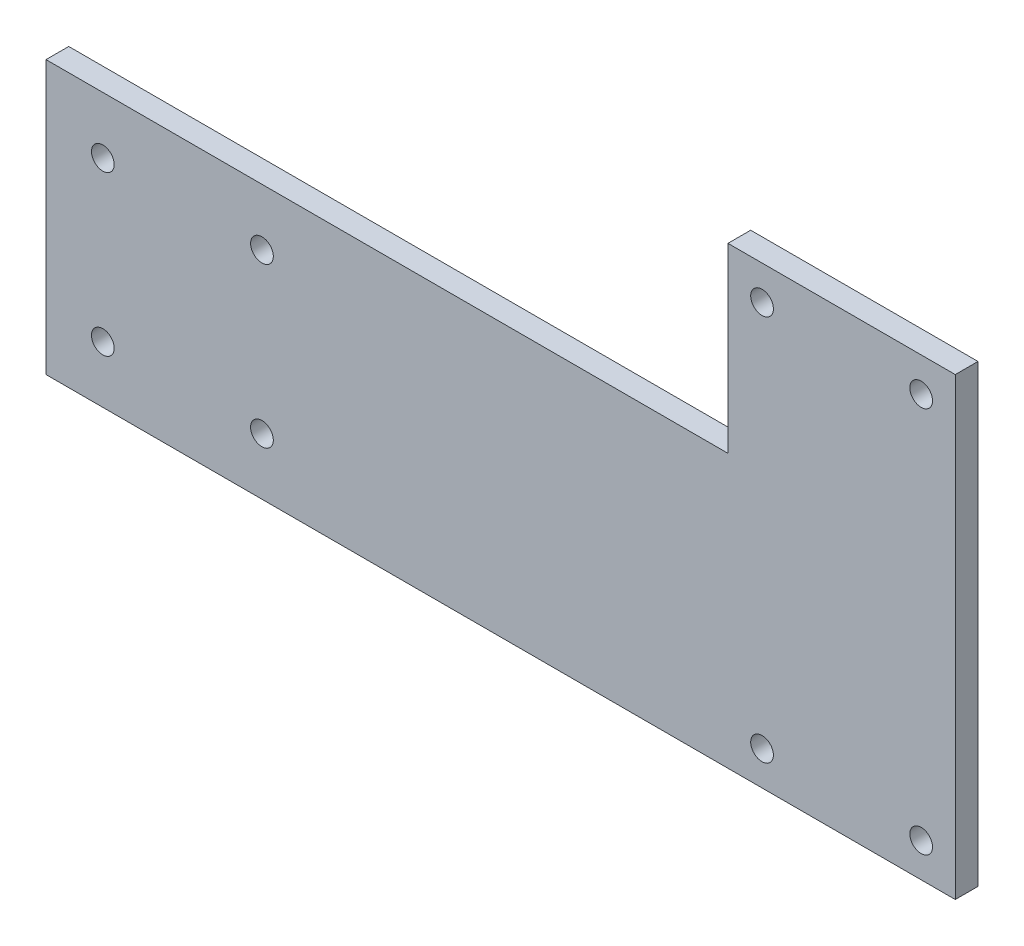
ISO-10303-21;
HEADER;
FILE_DESCRIPTION(('STEP AP214'),'2;1');
FILE_NAME('part.step','',(''),(''),'','','');
FILE_SCHEMA(('AUTOMOTIVE_DESIGN { 1 0 10303 214 1 1 1 1 }'));
ENDSEC;
DATA;
#1=APPLICATION_CONTEXT('core data for automotive mechanical design processes');
#2=APPLICATION_PROTOCOL_DEFINITION('international standard','automotive_design',2000,#1);
#3=PRODUCT_CONTEXT('',#1,'mechanical');
#4=PRODUCT('Part','Part','',(#3));
#5=PRODUCT_RELATED_PRODUCT_CATEGORY('part','',(#4));
#6=PRODUCT_DEFINITION_FORMATION('','',#4);
#7=PRODUCT_DEFINITION_CONTEXT('part definition',#1,'design');
#8=PRODUCT_DEFINITION('design','',#6,#7);
#9=PRODUCT_DEFINITION_SHAPE('','',#8);
#10=(LENGTH_UNIT() NAMED_UNIT(*) SI_UNIT(.MILLI.,.METRE.));
#11=(NAMED_UNIT(*) PLANE_ANGLE_UNIT() SI_UNIT($,.RADIAN.));
#12=(NAMED_UNIT(*) SI_UNIT($,.STERADIAN.) SOLID_ANGLE_UNIT());
#13=UNCERTAINTY_MEASURE_WITH_UNIT(LENGTH_MEASURE(1.E-05),#10,'distance_accuracy_value','');
#14=(GEOMETRIC_REPRESENTATION_CONTEXT(3) GLOBAL_UNCERTAINTY_ASSIGNED_CONTEXT((#13)) GLOBAL_UNIT_ASSIGNED_CONTEXT((#10,
#11,#12)) REPRESENTATION_CONTEXT('',''));
#15=CARTESIAN_POINT('',(0.,0.,0.));
#16=DIRECTION('',(0.,0.,1.));
#17=DIRECTION('',(1.,0.,0.));
#18=AXIS2_PLACEMENT_3D('',#15,#16,#17);
#19=CARTESIAN_POINT('',(0.,0.,5.));
#20=DIRECTION('',(0.,0.,1.));
#21=DIRECTION('',(1.,0.,0.));
#22=AXIS2_PLACEMENT_3D('',#19,#20,#21);
#23=PLANE('',#22);
#24=DIRECTION('',(0.,1.,0.));
#25=VECTOR('',#24,1.);
#26=CARTESIAN_POINT('',(50.,50.,5.));
#27=LINE('',#26,#25);
#28=CARTESIAN_POINT('',(50.,10.,5.));
#29=VERTEX_POINT('',#28);
#30=CARTESIAN_POINT('',(50.,50.,5.));
#31=VERTEX_POINT('',#30);
#32=EDGE_CURVE('E115',#29,#31,#27,.T.);
#33=ORIENTED_EDGE('',*,*,#32,.F.);
#34=DIRECTION('',(1.,0.,0.));
#35=VECTOR('',#34,1.);
#36=CARTESIAN_POINT('',(50.,10.,5.));
#37=LINE('',#36,#35);
#38=CARTESIAN_POINT('',(-100.,10.,5.));
#39=VERTEX_POINT('',#38);
#40=EDGE_CURVE('E107',#39,#29,#37,.T.);
#41=ORIENTED_EDGE('',*,*,#40,.F.);
#42=DIRECTION('',(0.,-1.,0.));
#43=VECTOR('',#42,1.);
#44=CARTESIAN_POINT('',(-100.,50.,5.));
#45=LINE('',#44,#43);
#46=CARTESIAN_POINT('',(-100.,-50.,5.));
#47=VERTEX_POINT('',#46);
#48=EDGE_CURVE('E113',#39,#47,#45,.T.);
#49=ORIENTED_EDGE('',*,*,#48,.T.);
#50=DIRECTION('',(1.,0.,0.));
#51=VECTOR('',#50,1.);
#52=CARTESIAN_POINT('',(-100.,-50.,5.));
#53=LINE('',#52,#51);
#54=CARTESIAN_POINT('',(100.,-50.,5.));
#55=VERTEX_POINT('',#54);
#56=EDGE_CURVE('E66',#47,#55,#53,.T.);
#57=ORIENTED_EDGE('',*,*,#56,.T.);
#58=DIRECTION('',(0.,1.,0.));
#59=VECTOR('',#58,1.);
#60=CARTESIAN_POINT('',(100.,50.,5.));
#61=LINE('',#60,#59);
#62=CARTESIAN_POINT('',(100.,50.,5.));
#63=VERTEX_POINT('',#62);
#64=EDGE_CURVE('E126',#55,#63,#61,.T.);
#65=ORIENTED_EDGE('',*,*,#64,.T.);
#66=DIRECTION('',(-1.,0.,0.));
#67=VECTOR('',#66,1.);
#68=CARTESIAN_POINT('',(-100.,50.,5.));
#69=LINE('',#68,#67);
#70=EDGE_CURVE('E90',#63,#31,#69,.T.);
#71=ORIENTED_EDGE('',*,*,#70,.T.);
#72=EDGE_LOOP('',(#33,#41,#49,#57,#65,#71));
#73=FACE_BOUND('',#72,.T.);
#74=CARTESIAN_POINT('',(-87.5,-2.5,5.));
#75=DIRECTION('',(0.,0.,1.));
#76=DIRECTION('',(1.,0.,0.));
#77=AXIS2_PLACEMENT_3D('',#74,#75,#76);
#78=CIRCLE('',#77,2.49999999999999);
#79=CARTESIAN_POINT('',(-85.,-2.5,5.));
#80=VERTEX_POINT('',#79);
#81=EDGE_CURVE('E175',#80,#80,#78,.T.);
#82=ORIENTED_EDGE('',*,*,#81,.F.);
#83=EDGE_LOOP('',(#82));
#84=FACE_BOUND('',#83,.T.);
#85=CARTESIAN_POINT('',(-52.5,-2.5,5.));
#86=DIRECTION('',(0.,0.,1.));
#87=DIRECTION('',(1.,0.,0.));
#88=AXIS2_PLACEMENT_3D('',#85,#86,#87);
#89=CIRCLE('',#88,2.5);
#90=CARTESIAN_POINT('',(-50.,-2.5,5.));
#91=VERTEX_POINT('',#90);
#92=EDGE_CURVE('E165',#91,#91,#89,.T.);
#93=ORIENTED_EDGE('',*,*,#92,.F.);
#94=EDGE_LOOP('',(#93));
#95=FACE_BOUND('',#94,.T.);
#96=CARTESIAN_POINT('',(57.5,42.5,5.));
#97=DIRECTION('',(0.,0.,1.));
#98=DIRECTION('',(1.,0.,0.));
#99=AXIS2_PLACEMENT_3D('',#96,#97,#98);
#100=CIRCLE('',#99,2.5);
#101=CARTESIAN_POINT('',(60.,42.5,5.));
#102=VERTEX_POINT('',#101);
#103=EDGE_CURVE('E191',#102,#102,#100,.T.);
#104=ORIENTED_EDGE('',*,*,#103,.F.);
#105=EDGE_LOOP('',(#104));
#106=FACE_BOUND('',#105,.T.);
#107=CARTESIAN_POINT('',(57.5,-42.5,5.));
#108=DIRECTION('',(0.,0.,1.));
#109=DIRECTION('',(1.,0.,0.));
#110=AXIS2_PLACEMENT_3D('',#107,#108,#109);
#111=CIRCLE('',#110,2.5);
#112=CARTESIAN_POINT('',(60.,-42.5,5.));
#113=VERTEX_POINT('',#112);
#114=EDGE_CURVE('E207',#113,#113,#111,.T.);
#115=ORIENTED_EDGE('',*,*,#114,.F.);
#116=EDGE_LOOP('',(#115));
#117=FACE_BOUND('',#116,.T.);
#118=CARTESIAN_POINT('',(-87.5,-37.5,5.));
#119=DIRECTION('',(0.,0.,1.));
#120=DIRECTION('',(1.,0.,0.));
#121=AXIS2_PLACEMENT_3D('',#118,#119,#120);
#122=CIRCLE('',#121,2.5);
#123=CARTESIAN_POINT('',(-85.,-37.5,5.));
#124=VERTEX_POINT('',#123);
#125=EDGE_CURVE('E135',#124,#124,#122,.T.);
#126=ORIENTED_EDGE('',*,*,#125,.F.);
#127=EDGE_LOOP('',(#126));
#128=FACE_BOUND('',#127,.T.);
#129=CARTESIAN_POINT('',(-52.5,-37.5,5.));
#130=DIRECTION('',(0.,0.,1.));
#131=DIRECTION('',(1.,0.,0.));
#132=AXIS2_PLACEMENT_3D('',#129,#130,#131);
#133=CIRCLE('',#132,2.5);
#134=CARTESIAN_POINT('',(-50.,-37.5,5.));
#135=VERTEX_POINT('',#134);
#136=EDGE_CURVE('E215',#135,#135,#133,.T.);
#137=ORIENTED_EDGE('',*,*,#136,.F.);
#138=EDGE_LOOP('',(#137));
#139=FACE_BOUND('',#138,.T.);
#140=CARTESIAN_POINT('',(92.5,-42.5,5.));
#141=DIRECTION('',(0.,0.,1.));
#142=DIRECTION('',(1.,0.,0.));
#143=AXIS2_PLACEMENT_3D('',#140,#141,#142);
#144=CIRCLE('',#143,2.5);
#145=CARTESIAN_POINT('',(95.,-42.5,5.));
#146=VERTEX_POINT('',#145);
#147=EDGE_CURVE('E199',#146,#146,#144,.T.);
#148=ORIENTED_EDGE('',*,*,#147,.F.);
#149=EDGE_LOOP('',(#148));
#150=FACE_BOUND('',#149,.T.);
#151=CARTESIAN_POINT('',(92.5,42.5,5.));
#152=DIRECTION('',(0.,0.,1.));
#153=DIRECTION('',(1.,0.,0.));
#154=AXIS2_PLACEMENT_3D('',#151,#152,#153);
#155=CIRCLE('',#154,2.5);
#156=CARTESIAN_POINT('',(95.,42.5,5.));
#157=VERTEX_POINT('',#156);
#158=EDGE_CURVE('E183',#157,#157,#155,.T.);
#159=ORIENTED_EDGE('',*,*,#158,.F.);
#160=EDGE_LOOP('',(#159));
#161=FACE_BOUND('',#160,.T.);
#162=ADVANCED_FACE('F42',(#73,#84,#95,#106,#117,#128,#139,#150,#161),#23,.T.);
#163=CARTESIAN_POINT('',(0.,0.,0.));
#164=DIRECTION('',(0.,0.,1.));
#165=DIRECTION('',(1.,0.,0.));
#166=AXIS2_PLACEMENT_3D('',#163,#164,#165);
#167=PLANE('',#166);
#168=CARTESIAN_POINT('',(-87.5,-2.5,0.));
#169=DIRECTION('',(0.,0.,1.));
#170=DIRECTION('',(1.,0.,0.));
#171=AXIS2_PLACEMENT_3D('',#168,#169,#170);
#172=CIRCLE('',#171,2.49999999999999);
#173=CARTESIAN_POINT('',(-85.,-2.5,0.));
#174=VERTEX_POINT('',#173);
#175=EDGE_CURVE('E173',#174,#174,#172,.T.);
#176=ORIENTED_EDGE('',*,*,#175,.T.);
#177=EDGE_LOOP('',(#176));
#178=FACE_BOUND('',#177,.T.);
#179=CARTESIAN_POINT('',(-52.5,-2.5,0.));
#180=DIRECTION('',(0.,0.,1.));
#181=DIRECTION('',(1.,0.,0.));
#182=AXIS2_PLACEMENT_3D('',#179,#180,#181);
#183=CIRCLE('',#182,2.5);
#184=CARTESIAN_POINT('',(-50.,-2.5,0.));
#185=VERTEX_POINT('',#184);
#186=EDGE_CURVE('E160',#185,#185,#183,.T.);
#187=ORIENTED_EDGE('',*,*,#186,.T.);
#188=EDGE_LOOP('',(#187));
#189=FACE_BOUND('',#188,.T.);
#190=DIRECTION('',(1.,0.,0.));
#191=VECTOR('',#190,1.);
#192=CARTESIAN_POINT('',(0.,10.,0.));
#193=LINE('',#192,#191);
#194=CARTESIAN_POINT('',(-100.,10.,0.));
#195=VERTEX_POINT('',#194);
#196=CARTESIAN_POINT('',(50.,10.,0.));
#197=VERTEX_POINT('',#196);
#198=EDGE_CURVE('E58',#195,#197,#193,.T.);
#199=ORIENTED_EDGE('',*,*,#198,.T.);
#200=DIRECTION('',(0.,1.,0.));
#201=VECTOR('',#200,1.);
#202=CARTESIAN_POINT('',(50.,0.,0.));
#203=LINE('',#202,#201);
#204=CARTESIAN_POINT('',(50.,50.,0.));
#205=VERTEX_POINT('',#204);
#206=EDGE_CURVE('E157',#197,#205,#203,.T.);
#207=ORIENTED_EDGE('',*,*,#206,.T.);
#208=DIRECTION('',(-1.,0.,0.));
#209=VECTOR('',#208,1.);
#210=CARTESIAN_POINT('',(-100.,50.,0.));
#211=LINE('',#210,#209);
#212=CARTESIAN_POINT('',(100.,50.,0.));
#213=VERTEX_POINT('',#212);
#214=EDGE_CURVE('E134',#213,#205,#211,.T.);
#215=ORIENTED_EDGE('',*,*,#214,.F.);
#216=DIRECTION('',(0.,1.,0.));
#217=VECTOR('',#216,1.);
#218=CARTESIAN_POINT('',(100.,50.,0.));
#219=LINE('',#218,#217);
#220=CARTESIAN_POINT('',(100.,-50.,0.));
#221=VERTEX_POINT('',#220);
#222=EDGE_CURVE('E130',#221,#213,#219,.T.);
#223=ORIENTED_EDGE('',*,*,#222,.F.);
#224=DIRECTION('',(1.,0.,0.));
#225=VECTOR('',#224,1.);
#226=CARTESIAN_POINT('',(-100.,-50.,0.));
#227=LINE('',#226,#225);
#228=CARTESIAN_POINT('',(-100.,-50.,0.));
#229=VERTEX_POINT('',#228);
#230=EDGE_CURVE('E83',#229,#221,#227,.T.);
#231=ORIENTED_EDGE('',*,*,#230,.F.);
#232=DIRECTION('',(0.,-1.,0.));
#233=VECTOR('',#232,1.);
#234=CARTESIAN_POINT('',(-100.,50.,0.));
#235=LINE('',#234,#233);
#236=EDGE_CURVE('E139',#195,#229,#235,.T.);
#237=ORIENTED_EDGE('',*,*,#236,.F.);
#238=EDGE_LOOP('',(#199,#207,#215,#223,#231,#237));
#239=FACE_BOUND('',#238,.T.);
#240=CARTESIAN_POINT('',(-87.5,-37.5,0.));
#241=DIRECTION('',(0.,0.,1.));
#242=DIRECTION('',(1.,0.,0.));
#243=AXIS2_PLACEMENT_3D('',#240,#241,#242);
#244=CIRCLE('',#243,2.5);
#245=CARTESIAN_POINT('',(-85.,-37.5,0.));
#246=VERTEX_POINT('',#245);
#247=EDGE_CURVE('E219',#246,#246,#244,.T.);
#248=ORIENTED_EDGE('',*,*,#247,.T.);
#249=EDGE_LOOP('',(#248));
#250=FACE_BOUND('',#249,.T.);
#251=CARTESIAN_POINT('',(-52.5,-37.5,0.));
#252=DIRECTION('',(0.,0.,1.));
#253=DIRECTION('',(1.,0.,0.));
#254=AXIS2_PLACEMENT_3D('',#251,#252,#253);
#255=CIRCLE('',#254,2.5);
#256=CARTESIAN_POINT('',(-50.,-37.5,0.));
#257=VERTEX_POINT('',#256);
#258=EDGE_CURVE('E211',#257,#257,#255,.T.);
#259=ORIENTED_EDGE('',*,*,#258,.T.);
#260=EDGE_LOOP('',(#259));
#261=FACE_BOUND('',#260,.T.);
#262=CARTESIAN_POINT('',(57.5,-42.5,0.));
#263=DIRECTION('',(0.,0.,1.));
#264=DIRECTION('',(1.,0.,0.));
#265=AXIS2_PLACEMENT_3D('',#262,#263,#264);
#266=CIRCLE('',#265,2.5);
#267=CARTESIAN_POINT('',(60.,-42.5,0.));
#268=VERTEX_POINT('',#267);
#269=EDGE_CURVE('E203',#268,#268,#266,.T.);
#270=ORIENTED_EDGE('',*,*,#269,.T.);
#271=EDGE_LOOP('',(#270));
#272=FACE_BOUND('',#271,.T.);
#273=CARTESIAN_POINT('',(92.5,-42.5,0.));
#274=DIRECTION('',(0.,0.,1.));
#275=DIRECTION('',(1.,0.,0.));
#276=AXIS2_PLACEMENT_3D('',#273,#274,#275);
#277=CIRCLE('',#276,2.5);
#278=CARTESIAN_POINT('',(95.,-42.5,0.));
#279=VERTEX_POINT('',#278);
#280=EDGE_CURVE('E195',#279,#279,#277,.T.);
#281=ORIENTED_EDGE('',*,*,#280,.T.);
#282=EDGE_LOOP('',(#281));
#283=FACE_BOUND('',#282,.T.);
#284=CARTESIAN_POINT('',(57.5,42.5,0.));
#285=DIRECTION('',(0.,0.,1.));
#286=DIRECTION('',(1.,0.,0.));
#287=AXIS2_PLACEMENT_3D('',#284,#285,#286);
#288=CIRCLE('',#287,2.5);
#289=CARTESIAN_POINT('',(60.,42.5,0.));
#290=VERTEX_POINT('',#289);
#291=EDGE_CURVE('E187',#290,#290,#288,.T.);
#292=ORIENTED_EDGE('',*,*,#291,.T.);
#293=EDGE_LOOP('',(#292));
#294=FACE_BOUND('',#293,.T.);
#295=CARTESIAN_POINT('',(92.5,42.5,0.));
#296=DIRECTION('',(0.,0.,1.));
#297=DIRECTION('',(1.,0.,0.));
#298=AXIS2_PLACEMENT_3D('',#295,#296,#297);
#299=CIRCLE('',#298,2.5);
#300=CARTESIAN_POINT('',(95.,42.5,0.));
#301=VERTEX_POINT('',#300);
#302=EDGE_CURVE('E179',#301,#301,#299,.T.);
#303=ORIENTED_EDGE('',*,*,#302,.T.);
#304=EDGE_LOOP('',(#303));
#305=FACE_BOUND('',#304,.T.);
#306=ADVANCED_FACE('F154',(#178,#189,#239,#250,#261,#272,#283,#294,#305),#167,.F.);
#307=CARTESIAN_POINT('',(100.,50.,5.));
#308=DIRECTION('',(-1.,0.,0.));
#309=DIRECTION('',(0.,0.,1.));
#310=AXIS2_PLACEMENT_3D('',#307,#308,#309);
#311=PLANE('',#310);
#312=ORIENTED_EDGE('',*,*,#222,.T.);
#313=DIRECTION('',(0.,0.,-1.));
#314=VECTOR('',#313,1.);
#315=CARTESIAN_POINT('',(100.,50.,5.));
#316=LINE('',#315,#314);
#317=EDGE_CURVE('E51',#63,#213,#316,.T.);
#318=ORIENTED_EDGE('',*,*,#317,.F.);
#319=ORIENTED_EDGE('',*,*,#64,.F.);
#320=DIRECTION('',(0.,0.,-1.));
#321=VECTOR('',#320,1.);
#322=CARTESIAN_POINT('',(100.,-50.,5.));
#323=LINE('',#322,#321);
#324=EDGE_CURVE('E124',#55,#221,#323,.T.);
#325=ORIENTED_EDGE('',*,*,#324,.T.);
#326=EDGE_LOOP('',(#312,#318,#319,#325));
#327=FACE_BOUND('',#326,.T.);
#328=ADVANCED_FACE('F44',(#327),#311,.F.);
#329=CARTESIAN_POINT('',(-100.,50.,5.));
#330=DIRECTION('',(0.,-1.,0.));
#331=DIRECTION('',(0.,0.,-1.));
#332=AXIS2_PLACEMENT_3D('',#329,#330,#331);
#333=PLANE('',#332);
#334=ORIENTED_EDGE('',*,*,#214,.T.);
#335=DIRECTION('',(0.,0.,1.));
#336=VECTOR('',#335,1.);
#337=CARTESIAN_POINT('',(50.,50.,-25.));
#338=LINE('',#337,#336);
#339=EDGE_CURVE('E167',#205,#31,#338,.T.);
#340=ORIENTED_EDGE('',*,*,#339,.T.);
#341=ORIENTED_EDGE('',*,*,#70,.F.);
#342=ORIENTED_EDGE('',*,*,#317,.T.);
#343=EDGE_LOOP('',(#334,#340,#341,#342));
#344=FACE_BOUND('',#343,.T.);
#345=ADVANCED_FACE('F149',(#344),#333,.F.);
#346=CARTESIAN_POINT('',(-100.,50.,5.));
#347=DIRECTION('',(1.,0.,0.));
#348=DIRECTION('',(0.,1.,0.));
#349=AXIS2_PLACEMENT_3D('',#346,#347,#348);
#350=PLANE('',#349);
#351=ORIENTED_EDGE('',*,*,#48,.F.);
#352=DIRECTION('',(0.,0.,-1.));
#353=VECTOR('',#352,1.);
#354=CARTESIAN_POINT('',(-100.,10.,5.));
#355=LINE('',#354,#353);
#356=EDGE_CURVE('E11',#39,#195,#355,.T.);
#357=ORIENTED_EDGE('',*,*,#356,.T.);
#358=ORIENTED_EDGE('',*,*,#236,.T.);
#359=DIRECTION('',(0.,0.,-1.));
#360=VECTOR('',#359,1.);
#361=CARTESIAN_POINT('',(-100.,-50.,5.));
#362=LINE('',#361,#360);
#363=EDGE_CURVE('E119',#47,#229,#362,.T.);
#364=ORIENTED_EDGE('',*,*,#363,.F.);
#365=EDGE_LOOP('',(#351,#357,#358,#364));
#366=FACE_BOUND('',#365,.T.);
#367=ADVANCED_FACE('F118',(#366),#350,.F.);
#368=CARTESIAN_POINT('',(-100.,-50.,5.));
#369=DIRECTION('',(0.,1.,0.));
#370=DIRECTION('',(-1.,0.,0.));
#371=AXIS2_PLACEMENT_3D('',#368,#369,#370);
#372=PLANE('',#371);
#373=ORIENTED_EDGE('',*,*,#230,.T.);
#374=ORIENTED_EDGE('',*,*,#324,.F.);
#375=ORIENTED_EDGE('',*,*,#56,.F.);
#376=ORIENTED_EDGE('',*,*,#363,.T.);
#377=EDGE_LOOP('',(#373,#374,#375,#376));
#378=FACE_BOUND('',#377,.T.);
#379=ADVANCED_FACE('F235',(#378),#372,.F.);
#380=CARTESIAN_POINT('',(-87.5,-37.5,5.));
#381=DIRECTION('',(0.,0.,-1.));
#382=DIRECTION('',(-1.,0.,0.));
#383=AXIS2_PLACEMENT_3D('',#380,#381,#382);
#384=CYLINDRICAL_SURFACE('',#383,2.5);
#385=ORIENTED_EDGE('',*,*,#125,.T.);
#386=EDGE_LOOP('',(#385));
#387=FACE_BOUND('',#386,.T.);
#388=ORIENTED_EDGE('',*,*,#247,.F.);
#389=EDGE_LOOP('',(#388));
#390=FACE_BOUND('',#389,.T.);
#391=ADVANCED_FACE('F232',(#387,#390),#384,.F.);
#392=CARTESIAN_POINT('',(-52.5,-37.5,5.));
#393=DIRECTION('',(0.,0.,-1.));
#394=DIRECTION('',(-1.,0.,0.));
#395=AXIS2_PLACEMENT_3D('',#392,#393,#394);
#396=CYLINDRICAL_SURFACE('',#395,2.5);
#397=ORIENTED_EDGE('',*,*,#136,.T.);
#398=EDGE_LOOP('',(#397));
#399=FACE_BOUND('',#398,.T.);
#400=ORIENTED_EDGE('',*,*,#258,.F.);
#401=EDGE_LOOP('',(#400));
#402=FACE_BOUND('',#401,.T.);
#403=ADVANCED_FACE('F234',(#399,#402),#396,.F.);
#404=CARTESIAN_POINT('',(57.5,-42.5,5.));
#405=DIRECTION('',(0.,0.,-1.));
#406=DIRECTION('',(-1.,0.,0.));
#407=AXIS2_PLACEMENT_3D('',#404,#405,#406);
#408=CYLINDRICAL_SURFACE('',#407,2.5);
#409=ORIENTED_EDGE('',*,*,#114,.T.);
#410=EDGE_LOOP('',(#409));
#411=FACE_BOUND('',#410,.T.);
#412=ORIENTED_EDGE('',*,*,#269,.F.);
#413=EDGE_LOOP('',(#412));
#414=FACE_BOUND('',#413,.T.);
#415=ADVANCED_FACE('F242',(#411,#414),#408,.F.);
#416=CARTESIAN_POINT('',(92.5,-42.5,5.));
#417=DIRECTION('',(0.,0.,-1.));
#418=DIRECTION('',(-1.,0.,0.));
#419=AXIS2_PLACEMENT_3D('',#416,#417,#418);
#420=CYLINDRICAL_SURFACE('',#419,2.5);
#421=ORIENTED_EDGE('',*,*,#147,.T.);
#422=EDGE_LOOP('',(#421));
#423=FACE_BOUND('',#422,.T.);
#424=ORIENTED_EDGE('',*,*,#280,.F.);
#425=EDGE_LOOP('',(#424));
#426=FACE_BOUND('',#425,.T.);
#427=ADVANCED_FACE('F343',(#423,#426),#420,.F.);
#428=CARTESIAN_POINT('',(57.5,42.5,5.));
#429=DIRECTION('',(0.,0.,-1.));
#430=DIRECTION('',(-1.,0.,0.));
#431=AXIS2_PLACEMENT_3D('',#428,#429,#430);
#432=CYLINDRICAL_SURFACE('',#431,2.5);
#433=ORIENTED_EDGE('',*,*,#103,.T.);
#434=EDGE_LOOP('',(#433));
#435=FACE_BOUND('',#434,.T.);
#436=ORIENTED_EDGE('',*,*,#291,.F.);
#437=EDGE_LOOP('',(#436));
#438=FACE_BOUND('',#437,.T.);
#439=ADVANCED_FACE('F333',(#435,#438),#432,.F.);
#440=CARTESIAN_POINT('',(92.5,42.5,5.));
#441=DIRECTION('',(0.,0.,-1.));
#442=DIRECTION('',(-1.,0.,0.));
#443=AXIS2_PLACEMENT_3D('',#440,#441,#442);
#444=CYLINDRICAL_SURFACE('',#443,2.5);
#445=ORIENTED_EDGE('',*,*,#158,.T.);
#446=EDGE_LOOP('',(#445));
#447=FACE_BOUND('',#446,.T.);
#448=ORIENTED_EDGE('',*,*,#302,.F.);
#449=EDGE_LOOP('',(#448));
#450=FACE_BOUND('',#449,.T.);
#451=ADVANCED_FACE('F323',(#447,#450),#444,.F.);
#452=CARTESIAN_POINT('',(-52.5,-2.5,0.));
#453=DIRECTION('',(0.,0.,1.));
#454=DIRECTION('',(1.,0.,0.));
#455=AXIS2_PLACEMENT_3D('',#452,#453,#454);
#456=CYLINDRICAL_SURFACE('',#455,2.5);
#457=ORIENTED_EDGE('',*,*,#186,.F.);
#458=EDGE_LOOP('',(#457));
#459=FACE_BOUND('',#458,.T.);
#460=ORIENTED_EDGE('',*,*,#92,.T.);
#461=EDGE_LOOP('',(#460));
#462=FACE_BOUND('',#461,.T.);
#463=ADVANCED_FACE('F314',(#459,#462),#456,.F.);
#464=CARTESIAN_POINT('',(-87.5,-2.5,0.));
#465=DIRECTION('',(0.,0.,1.));
#466=DIRECTION('',(1.,0.,0.));
#467=AXIS2_PLACEMENT_3D('',#464,#465,#466);
#468=CYLINDRICAL_SURFACE('',#467,2.49999999999999);
#469=ORIENTED_EDGE('',*,*,#175,.F.);
#470=EDGE_LOOP('',(#469));
#471=FACE_BOUND('',#470,.T.);
#472=ORIENTED_EDGE('',*,*,#81,.T.);
#473=EDGE_LOOP('',(#472));
#474=FACE_BOUND('',#473,.T.);
#475=ADVANCED_FACE('F293',(#471,#474),#468,.F.);
#476=CARTESIAN_POINT('',(50.,50.,-25.));
#477=DIRECTION('',(1.,0.,0.));
#478=DIRECTION('',(0.,1.,0.));
#479=AXIS2_PLACEMENT_3D('',#476,#477,#478);
#480=PLANE('',#479);
#481=DIRECTION('',(0.,0.,1.));
#482=VECTOR('',#481,1.);
#483=CARTESIAN_POINT('',(50.,10.,-25.));
#484=LINE('',#483,#482);
#485=EDGE_CURVE('E443',#197,#29,#484,.T.);
#486=ORIENTED_EDGE('',*,*,#485,.T.);
#487=ORIENTED_EDGE('',*,*,#32,.T.);
#488=ORIENTED_EDGE('',*,*,#339,.F.);
#489=ORIENTED_EDGE('',*,*,#206,.F.);
#490=EDGE_LOOP('',(#486,#487,#488,#489));
#491=FACE_BOUND('',#490,.T.);
#492=ADVANCED_FACE('F288',(#491),#480,.F.);
#493=CARTESIAN_POINT('',(50.,10.,-25.));
#494=DIRECTION('',(0.,-1.,0.));
#495=DIRECTION('',(1.,0.,0.));
#496=AXIS2_PLACEMENT_3D('',#493,#494,#495);
#497=PLANE('',#496);
#498=ORIENTED_EDGE('',*,*,#356,.F.);
#499=ORIENTED_EDGE('',*,*,#40,.T.);
#500=ORIENTED_EDGE('',*,*,#485,.F.);
#501=ORIENTED_EDGE('',*,*,#198,.F.);
#502=EDGE_LOOP('',(#498,#499,#500,#501));
#503=FACE_BOUND('',#502,.T.);
#504=ADVANCED_FACE('F106',(#503),#497,.F.);
#505=CLOSED_SHELL('',(#162,#306,#328,#345,#367,#379,#391,#403,#415,#427,#439,#451,#463,#475,
#492,#504));
#506=MANIFOLD_SOLID_BREP('B2',#505);
#507=ADVANCED_BREP_SHAPE_REPRESENTATION('',(#18,#506),#14);
#508=SHAPE_DEFINITION_REPRESENTATION(#9,#507);
ENDSEC;
END-ISO-10303-21;
